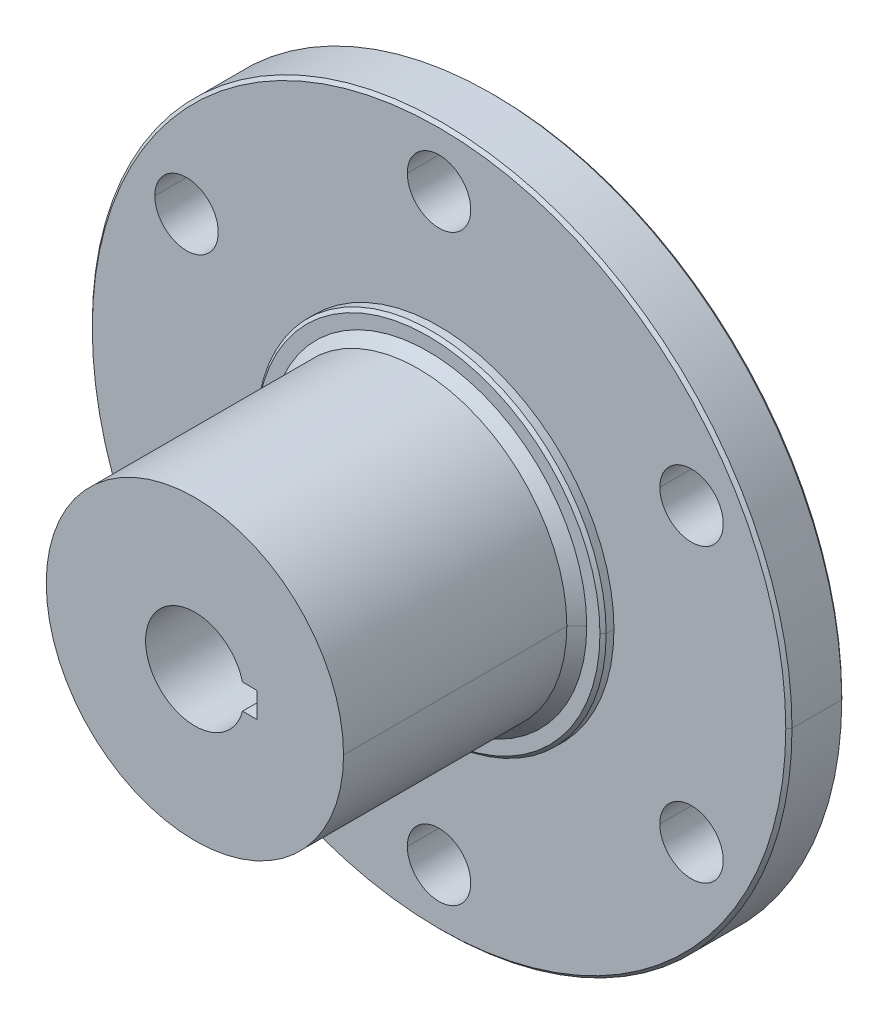
ISO-10303-21;
HEADER;
FILE_DESCRIPTION(('STEP AP214'),'2;1');
FILE_NAME('part.step','',(''),(''),'','','');
FILE_SCHEMA(('AUTOMOTIVE_DESIGN { 1 0 10303 214 1 1 1 1 }'));
ENDSEC;
DATA;
#1=APPLICATION_CONTEXT('core data for automotive mechanical design processes');
#2=APPLICATION_PROTOCOL_DEFINITION('international standard','automotive_design',2000,#1);
#3=PRODUCT_CONTEXT('',#1,'mechanical');
#4=PRODUCT('Part','Part','',(#3));
#5=PRODUCT_RELATED_PRODUCT_CATEGORY('part','',(#4));
#6=PRODUCT_DEFINITION_FORMATION('','',#4);
#7=PRODUCT_DEFINITION_CONTEXT('part definition',#1,'design');
#8=PRODUCT_DEFINITION('design','',#6,#7);
#9=PRODUCT_DEFINITION_SHAPE('','',#8);
#10=(LENGTH_UNIT() NAMED_UNIT(*) SI_UNIT(.MILLI.,.METRE.));
#11=(NAMED_UNIT(*) PLANE_ANGLE_UNIT() SI_UNIT($,.RADIAN.));
#12=(NAMED_UNIT(*) SI_UNIT($,.STERADIAN.) SOLID_ANGLE_UNIT());
#13=UNCERTAINTY_MEASURE_WITH_UNIT(LENGTH_MEASURE(1.E-05),#10,'distance_accuracy_value','');
#14=(GEOMETRIC_REPRESENTATION_CONTEXT(3) GLOBAL_UNCERTAINTY_ASSIGNED_CONTEXT((#13)) GLOBAL_UNIT_ASSIGNED_CONTEXT((#10,
#11,#12)) REPRESENTATION_CONTEXT('',''));
#15=CARTESIAN_POINT('',(0.,0.,0.));
#16=DIRECTION('',(0.,0.,1.));
#17=DIRECTION('',(1.,0.,0.));
#18=AXIS2_PLACEMENT_3D('',#15,#16,#17);
#19=CARTESIAN_POINT('',(0.,0.,7.1628));
#20=DIRECTION('',(0.,0.,-1.));
#21=DIRECTION('',(-1.,0.,0.));
#22=AXIS2_PLACEMENT_3D('',#19,#20,#21);
#23=CONICAL_SURFACE('',#22,12.1412,0.785398163397445);
#24=DIRECTION('',(0.707106781186545,0.,-0.70710678118655));
#25=VECTOR('',#24,1.);
#26=CARTESIAN_POINT('',(12.1412,0.,7.1628));
#27=LINE('',#26,#25);
#28=CARTESIAN_POINT('',(12.1412,0.,7.1628));
#29=VERTEX_POINT('',#28);
#30=CARTESIAN_POINT('',(12.954,0.,6.35));
#31=VERTEX_POINT('',#30);
#32=EDGE_CURVE('E488',#29,#31,#27,.T.);
#33=ORIENTED_EDGE('',*,*,#32,.F.);
#34=CARTESIAN_POINT('',(0.,0.,7.1628));
#35=DIRECTION('',(0.,0.,1.));
#36=DIRECTION('',(1.,0.,0.));
#37=AXIS2_PLACEMENT_3D('',#34,#35,#36);
#38=CIRCLE('',#37,12.1412);
#39=CARTESIAN_POINT('',(-12.1412,0.,7.1628));
#40=VERTEX_POINT('',#39);
#41=EDGE_CURVE('E375',#40,#29,#38,.T.);
#42=ORIENTED_EDGE('',*,*,#41,.F.);
#43=DIRECTION('',(-0.707106781186545,0.,-0.70710678118655));
#44=VECTOR('',#43,1.);
#45=CARTESIAN_POINT('',(-12.1412,0.,7.1628));
#46=LINE('',#45,#44);
#47=CARTESIAN_POINT('',(-12.954,0.,6.35));
#48=VERTEX_POINT('',#47);
#49=EDGE_CURVE('E515',#40,#48,#46,.T.);
#50=ORIENTED_EDGE('',*,*,#49,.T.);
#51=CARTESIAN_POINT('',(0.,0.,6.35));
#52=DIRECTION('',(0.,0.,-1.));
#53=DIRECTION('',(1.,0.,0.));
#54=AXIS2_PLACEMENT_3D('',#51,#52,#53);
#55=CIRCLE('',#54,12.954);
#56=EDGE_CURVE('E365',#31,#48,#55,.T.);
#57=ORIENTED_EDGE('',*,*,#56,.F.);
#58=EDGE_LOOP('',(#33,#42,#50,#57));
#59=FACE_BOUND('',#58,.T.);
#60=ADVANCED_FACE('F17',(#59),#23,.T.);
#61=CARTESIAN_POINT('',(0.,0.,0.889));
#62=DIRECTION('',(0.,0.,1.));
#63=DIRECTION('',(1.,0.,0.));
#64=AXIS2_PLACEMENT_3D('',#61,#62,#63);
#65=CONICAL_SURFACE('',#64,28.321,0.785398163397455);
#66=DIRECTION('',(-0.707106781186552,0.,0.707106781186543));
#67=VECTOR('',#66,1.);
#68=CARTESIAN_POINT('',(-28.321,0.,0.889));
#69=LINE('',#68,#67);
#70=CARTESIAN_POINT('',(-28.321,0.,0.889));
#71=VERTEX_POINT('',#70);
#72=CARTESIAN_POINT('',(-28.575,0.,1.143));
#73=VERTEX_POINT('',#72);
#74=EDGE_CURVE('E526',#71,#73,#69,.T.);
#75=ORIENTED_EDGE('',*,*,#74,.F.);
#76=CARTESIAN_POINT('',(0.,0.,0.889));
#77=DIRECTION('',(0.,0.,-1.));
#78=DIRECTION('',(-1.,0.,0.));
#79=AXIS2_PLACEMENT_3D('',#76,#77,#78);
#80=CIRCLE('',#79,28.321);
#81=CARTESIAN_POINT('',(28.321,0.,0.889));
#82=VERTEX_POINT('',#81);
#83=EDGE_CURVE('E178',#82,#71,#80,.T.);
#84=ORIENTED_EDGE('',*,*,#83,.F.);
#85=DIRECTION('',(0.707106781186552,0.,0.707106781186543));
#86=VECTOR('',#85,1.);
#87=CARTESIAN_POINT('',(28.321,0.,0.889));
#88=LINE('',#87,#86);
#89=CARTESIAN_POINT('',(28.575,0.,1.143));
#90=VERTEX_POINT('',#89);
#91=EDGE_CURVE('E377',#82,#90,#88,.T.);
#92=ORIENTED_EDGE('',*,*,#91,.T.);
#93=CARTESIAN_POINT('',(0.,0.,1.143));
#94=DIRECTION('',(0.,0.,1.));
#95=DIRECTION('',(-1.,0.,0.));
#96=AXIS2_PLACEMENT_3D('',#93,#94,#95);
#97=CIRCLE('',#96,28.575);
#98=EDGE_CURVE('E165',#73,#90,#97,.T.);
#99=ORIENTED_EDGE('',*,*,#98,.F.);
#100=EDGE_LOOP('',(#75,#84,#92,#99));
#101=FACE_BOUND('',#100,.T.);
#102=ADVANCED_FACE('F654',(#101),#65,.T.);
#103=CARTESIAN_POINT('',(0.,0.,5.207));
#104=DIRECTION('',(0.,0.,-1.));
#105=DIRECTION('',(-1.,0.,0.));
#106=AXIS2_PLACEMENT_3D('',#103,#104,#105);
#107=CONICAL_SURFACE('',#106,28.575,0.785398163397455);
#108=DIRECTION('',(0.707106781186552,0.,-0.707106781186543));
#109=VECTOR('',#108,1.);
#110=CARTESIAN_POINT('',(28.575,0.,5.207));
#111=LINE('',#110,#109);
#112=CARTESIAN_POINT('',(28.321,0.,5.461));
#113=VERTEX_POINT('',#112);
#114=CARTESIAN_POINT('',(28.575,0.,5.207));
#115=VERTEX_POINT('',#114);
#116=EDGE_CURVE('E467',#113,#115,#111,.T.);
#117=ORIENTED_EDGE('',*,*,#116,.F.);
#118=CARTESIAN_POINT('',(0.,0.,5.461));
#119=DIRECTION('',(0.,0.,1.));
#120=DIRECTION('',(-1.,0.,0.));
#121=AXIS2_PLACEMENT_3D('',#118,#119,#120);
#122=CIRCLE('',#121,28.321);
#123=CARTESIAN_POINT('',(-28.321,0.,5.461));
#124=VERTEX_POINT('',#123);
#125=EDGE_CURVE('E426',#124,#113,#122,.T.);
#126=ORIENTED_EDGE('',*,*,#125,.F.);
#127=DIRECTION('',(-0.707106781186552,0.,-0.707106781186543));
#128=VECTOR('',#127,1.);
#129=CARTESIAN_POINT('',(-28.575,0.,5.207));
#130=LINE('',#129,#128);
#131=CARTESIAN_POINT('',(-28.575,0.,5.207));
#132=VERTEX_POINT('',#131);
#133=EDGE_CURVE('E576',#124,#132,#130,.T.);
#134=ORIENTED_EDGE('',*,*,#133,.T.);
#135=CARTESIAN_POINT('',(0.,0.,5.207));
#136=DIRECTION('',(0.,0.,-1.));
#137=DIRECTION('',(-1.,0.,0.));
#138=AXIS2_PLACEMENT_3D('',#135,#136,#137);
#139=CIRCLE('',#138,28.575);
#140=EDGE_CURVE('E393',#115,#132,#139,.T.);
#141=ORIENTED_EDGE('',*,*,#140,.F.);
#142=EDGE_LOOP('',(#117,#126,#134,#141));
#143=FACE_BOUND('',#142,.T.);
#144=ADVANCED_FACE('F656',(#143),#107,.T.);
#145=CARTESIAN_POINT('',(0.,0.,0.));
#146=DIRECTION('',(0.,0.,1.));
#147=DIRECTION('',(1.,0.,0.));
#148=AXIS2_PLACEMENT_3D('',#145,#146,#147);
#149=CONICAL_SURFACE('',#148,14.1003226197908,0.785398163397448);
#150=DIRECTION('',(-0.707106781186548,0.,0.707106781186548));
#151=VECTOR('',#150,1.);
#152=CARTESIAN_POINT('',(-14.1003226197908,0.,0.));
#153=LINE('',#152,#151);
#154=CARTESIAN_POINT('',(-14.1003226197908,0.,0.));
#155=VERTEX_POINT('',#154);
#156=CARTESIAN_POINT('',(-14.3543226197908,0.,0.254000000000009));
#157=VERTEX_POINT('',#156);
#158=EDGE_CURVE('E355',#155,#157,#153,.T.);
#159=ORIENTED_EDGE('',*,*,#158,.F.);
#160=CARTESIAN_POINT('',(0.,0.,0.));
#161=DIRECTION('',(0.,0.,-1.));
#162=DIRECTION('',(1.,0.,0.));
#163=AXIS2_PLACEMENT_3D('',#160,#161,#162);
#164=CIRCLE('',#163,14.1003226197908);
#165=CARTESIAN_POINT('',(14.1003226197908,0.,0.));
#166=VERTEX_POINT('',#165);
#167=EDGE_CURVE('E371',#166,#155,#164,.T.);
#168=ORIENTED_EDGE('',*,*,#167,.F.);
#169=DIRECTION('',(0.707106781186548,0.,0.707106781186548));
#170=VECTOR('',#169,1.);
#171=CARTESIAN_POINT('',(14.1003226197908,0.,0.));
#172=LINE('',#171,#170);
#173=CARTESIAN_POINT('',(14.3543226197908,0.,0.254000000000009));
#174=VERTEX_POINT('',#173);
#175=EDGE_CURVE('E354',#166,#174,#172,.T.);
#176=ORIENTED_EDGE('',*,*,#175,.T.);
#177=CARTESIAN_POINT('',(0.,0.,0.254000000000009));
#178=DIRECTION('',(0.,0.,1.));
#179=DIRECTION('',(1.,0.,0.));
#180=AXIS2_PLACEMENT_3D('',#177,#178,#179);
#181=CIRCLE('',#180,14.3543226197908);
#182=EDGE_CURVE('E322',#157,#174,#181,.T.);
#183=ORIENTED_EDGE('',*,*,#182,.F.);
#184=EDGE_LOOP('',(#159,#168,#176,#183));
#185=FACE_BOUND('',#184,.T.);
#186=ADVANCED_FACE('F663',(#185),#149,.T.);
#187=CARTESIAN_POINT('',(0.,0.,6.35));
#188=DIRECTION('',(0.,0.,-1.));
#189=DIRECTION('',(-1.,0.,0.));
#190=AXIS2_PLACEMENT_3D('',#187,#188,#189);
#191=CONICAL_SURFACE('',#190,14.0335,0.785398163397421);
#192=DIRECTION('',(0.707106781186528,0.,-0.707106781186567));
#193=VECTOR('',#192,1.);
#194=CARTESIAN_POINT('',(14.0335,0.,6.35));
#195=LINE('',#194,#193);
#196=CARTESIAN_POINT('',(14.0335,0.,6.35));
#197=VERTEX_POINT('',#196);
#198=CARTESIAN_POINT('',(14.2875,0.,6.096));
#199=VERTEX_POINT('',#198);
#200=EDGE_CURVE('E439',#197,#199,#195,.T.);
#201=ORIENTED_EDGE('',*,*,#200,.F.);
#202=CARTESIAN_POINT('',(0.,0.,6.35));
#203=DIRECTION('',(0.,0.,1.));
#204=DIRECTION('',(1.,0.,0.));
#205=AXIS2_PLACEMENT_3D('',#202,#203,#204);
#206=CIRCLE('',#205,14.0335);
#207=CARTESIAN_POINT('',(-14.0335,0.,6.35));
#208=VERTEX_POINT('',#207);
#209=EDGE_CURVE('E362',#208,#197,#206,.T.);
#210=ORIENTED_EDGE('',*,*,#209,.F.);
#211=DIRECTION('',(-0.707106781186528,0.,-0.707106781186567));
#212=VECTOR('',#211,1.);
#213=CARTESIAN_POINT('',(-14.0335,0.,6.35));
#214=LINE('',#213,#212);
#215=CARTESIAN_POINT('',(-14.2875,0.,6.096));
#216=VERTEX_POINT('',#215);
#217=EDGE_CURVE('E586',#208,#216,#214,.T.);
#218=ORIENTED_EDGE('',*,*,#217,.T.);
#219=CARTESIAN_POINT('',(0.,0.,6.096));
#220=DIRECTION('',(0.,0.,-1.));
#221=DIRECTION('',(1.,0.,0.));
#222=AXIS2_PLACEMENT_3D('',#219,#220,#221);
#223=CIRCLE('',#222,14.2875);
#224=EDGE_CURVE('E11',#199,#216,#223,.T.);
#225=ORIENTED_EDGE('',*,*,#224,.F.);
#226=EDGE_LOOP('',(#201,#210,#218,#225));
#227=FACE_BOUND('',#226,.T.);
#228=ADVANCED_FACE('F991',(#227),#191,.T.);
#229=CARTESIAN_POINT('',(0.,0.,0.));
#230=DIRECTION('',(0.,0.,-1.));
#231=DIRECTION('',(-1.,0.,0.));
#232=AXIS2_PLACEMENT_3D('',#229,#230,#231);
#233=CYLINDRICAL_SURFACE('',#232,14.2875);
#234=DIRECTION('',(0.,0.,-1.));
#235=VECTOR('',#234,1.);
#236=CARTESIAN_POINT('',(14.2875,0.,0.));
#237=LINE('',#236,#235);
#238=CARTESIAN_POINT('',(14.2875,0.,5.461));
#239=VERTEX_POINT('',#238);
#240=EDGE_CURVE('E583',#199,#239,#237,.T.);
#241=ORIENTED_EDGE('',*,*,#240,.F.);
#242=ORIENTED_EDGE('',*,*,#224,.T.);
#243=DIRECTION('',(0.,0.,-1.));
#244=VECTOR('',#243,1.);
#245=CARTESIAN_POINT('',(-14.2875,0.,0.));
#246=LINE('',#245,#244);
#247=CARTESIAN_POINT('',(-14.2875,0.,5.461));
#248=VERTEX_POINT('',#247);
#249=EDGE_CURVE('E335',#216,#248,#246,.T.);
#250=ORIENTED_EDGE('',*,*,#249,.T.);
#251=CARTESIAN_POINT('',(0.,0.,5.461));
#252=DIRECTION('',(0.,0.,-1.));
#253=DIRECTION('',(-1.,0.,0.));
#254=AXIS2_PLACEMENT_3D('',#251,#252,#253);
#255=CIRCLE('',#254,14.2875);
#256=EDGE_CURVE('E28',#239,#248,#255,.T.);
#257=ORIENTED_EDGE('',*,*,#256,.F.);
#258=EDGE_LOOP('',(#241,#242,#250,#257));
#259=FACE_BOUND('',#258,.T.);
#260=ADVANCED_FACE('F696',(#259),#233,.T.);
#261=CARTESIAN_POINT('',(-62.1712615480534,0.,5.461));
#262=DIRECTION('',(0.,0.,-1.));
#263=DIRECTION('',(0.,-1.,0.));
#264=AXIS2_PLACEMENT_3D('',#261,#262,#263);
#265=PLANE('',#264);
#266=CARTESIAN_POINT('',(-20.622229927617,11.90625,5.461));
#267=DIRECTION('',(0.,0.,1.));
#268=DIRECTION('',(-1.,0.,0.));
#269=AXIS2_PLACEMENT_3D('',#266,#267,#268);
#270=CIRCLE('',#269,2.5908);
#271=CARTESIAN_POINT('',(-18.031429927617,11.90625,5.461));
#272=VERTEX_POINT('',#271);
#273=CARTESIAN_POINT('',(-23.213029927617,11.90625,5.461));
#274=VERTEX_POINT('',#273);
#275=EDGE_CURVE('E422',#272,#274,#270,.T.);
#276=ORIENTED_EDGE('',*,*,#275,.F.);
#277=CARTESIAN_POINT('',(-20.622229927617,11.90625,5.461));
#278=DIRECTION('',(0.,0.,1.));
#279=DIRECTION('',(-1.,0.,0.));
#280=AXIS2_PLACEMENT_3D('',#277,#278,#279);
#281=CIRCLE('',#280,2.5908);
#282=EDGE_CURVE('E542',#274,#272,#281,.T.);
#283=ORIENTED_EDGE('',*,*,#282,.F.);
#284=EDGE_LOOP('',(#276,#283));
#285=FACE_BOUND('',#284,.T.);
#286=CARTESIAN_POINT('',(0.,-23.8125,5.461));
#287=DIRECTION('',(0.,0.,1.));
#288=DIRECTION('',(-1.,0.,0.));
#289=AXIS2_PLACEMENT_3D('',#286,#287,#288);
#290=CIRCLE('',#289,2.5908);
#291=CARTESIAN_POINT('',(2.5908,-23.8125,5.461));
#292=VERTEX_POINT('',#291);
#293=CARTESIAN_POINT('',(-2.5908,-23.8125,5.461));
#294=VERTEX_POINT('',#293);
#295=EDGE_CURVE('E563',#292,#294,#290,.T.);
#296=ORIENTED_EDGE('',*,*,#295,.F.);
#297=CARTESIAN_POINT('',(0.,-23.8125,5.461));
#298=DIRECTION('',(0.,0.,1.));
#299=DIRECTION('',(-1.,0.,0.));
#300=AXIS2_PLACEMENT_3D('',#297,#298,#299);
#301=CIRCLE('',#300,2.5908);
#302=EDGE_CURVE('E386',#294,#292,#301,.T.);
#303=ORIENTED_EDGE('',*,*,#302,.F.);
#304=EDGE_LOOP('',(#296,#303));
#305=FACE_BOUND('',#304,.T.);
#306=CARTESIAN_POINT('',(20.6222299276168,11.9062500000002,5.461));
#307=DIRECTION('',(0.,0.,1.));
#308=DIRECTION('',(-1.,0.,0.));
#309=AXIS2_PLACEMENT_3D('',#306,#307,#308);
#310=CIRCLE('',#309,2.5908);
#311=CARTESIAN_POINT('',(23.2130299276168,11.9062500000002,5.461));
#312=VERTEX_POINT('',#311);
#313=CARTESIAN_POINT('',(18.0314299276168,11.9062500000002,5.461));
#314=VERTEX_POINT('',#313);
#315=EDGE_CURVE('E367',#312,#314,#310,.T.);
#316=ORIENTED_EDGE('',*,*,#315,.F.);
#317=CARTESIAN_POINT('',(20.6222299276168,11.9062500000002,5.461));
#318=DIRECTION('',(0.,0.,1.));
#319=DIRECTION('',(-1.,0.,0.));
#320=AXIS2_PLACEMENT_3D('',#317,#318,#319);
#321=CIRCLE('',#320,2.5908);
#322=EDGE_CURVE('E429',#314,#312,#321,.T.);
#323=ORIENTED_EDGE('',*,*,#322,.F.);
#324=EDGE_LOOP('',(#316,#323));
#325=FACE_BOUND('',#324,.T.);
#326=CARTESIAN_POINT('',(0.,0.,5.461));
#327=DIRECTION('',(0.,0.,-1.));
#328=DIRECTION('',(-1.,0.,0.));
#329=AXIS2_PLACEMENT_3D('',#326,#327,#328);
#330=CIRCLE('',#329,14.2875);
#331=EDGE_CURVE('E343',#248,#239,#330,.T.);
#332=ORIENTED_EDGE('',*,*,#331,.T.);
#333=ORIENTED_EDGE('',*,*,#256,.T.);
#334=EDGE_LOOP('',(#332,#333));
#335=FACE_BOUND('',#334,.T.);
#336=CARTESIAN_POINT('',(20.622229927617,-11.9062499999998,5.461));
#337=DIRECTION('',(0.,0.,1.));
#338=DIRECTION('',(-1.,0.,0.));
#339=AXIS2_PLACEMENT_3D('',#336,#337,#338);
#340=CIRCLE('',#339,2.5908);
#341=CARTESIAN_POINT('',(23.2130299276171,-11.9062499999998,5.461));
#342=VERTEX_POINT('',#341);
#343=CARTESIAN_POINT('',(18.0314299276171,-11.9062499999998,5.461));
#344=VERTEX_POINT('',#343);
#345=EDGE_CURVE('E475',#342,#344,#340,.T.);
#346=ORIENTED_EDGE('',*,*,#345,.F.);
#347=CARTESIAN_POINT('',(20.622229927617,-11.9062499999998,5.461));
#348=DIRECTION('',(0.,0.,1.));
#349=DIRECTION('',(-1.,0.,0.));
#350=AXIS2_PLACEMENT_3D('',#347,#348,#349);
#351=CIRCLE('',#350,2.5908);
#352=EDGE_CURVE('E356',#344,#342,#351,.T.);
#353=ORIENTED_EDGE('',*,*,#352,.F.);
#354=EDGE_LOOP('',(#346,#353));
#355=FACE_BOUND('',#354,.T.);
#356=CARTESIAN_POINT('',(-20.6222299276169,-11.90625,5.461));
#357=DIRECTION('',(0.,0.,1.));
#358=DIRECTION('',(-1.,0.,0.));
#359=AXIS2_PLACEMENT_3D('',#356,#357,#358);
#360=CIRCLE('',#359,2.5908);
#361=CARTESIAN_POINT('',(-18.0314299276169,-11.90625,5.461));
#362=VERTEX_POINT('',#361);
#363=CARTESIAN_POINT('',(-23.2130299276169,-11.90625,5.461));
#364=VERTEX_POINT('',#363);
#365=EDGE_CURVE('E448',#362,#364,#360,.T.);
#366=ORIENTED_EDGE('',*,*,#365,.F.);
#367=CARTESIAN_POINT('',(-20.6222299276169,-11.90625,5.461));
#368=DIRECTION('',(0.,0.,1.));
#369=DIRECTION('',(-1.,0.,0.));
#370=AXIS2_PLACEMENT_3D('',#367,#368,#369);
#371=CIRCLE('',#370,2.5908);
#372=EDGE_CURVE('E556',#364,#362,#371,.T.);
#373=ORIENTED_EDGE('',*,*,#372,.F.);
#374=EDGE_LOOP('',(#366,#373));
#375=FACE_BOUND('',#374,.T.);
#376=CARTESIAN_POINT('',(0.,23.8125,5.461));
#377=DIRECTION('',(0.,0.,1.));
#378=DIRECTION('',(-1.,0.,0.));
#379=AXIS2_PLACEMENT_3D('',#376,#377,#378);
#380=CIRCLE('',#379,2.5908);
#381=CARTESIAN_POINT('',(2.5908,23.8125,5.461));
#382=VERTEX_POINT('',#381);
#383=CARTESIAN_POINT('',(-2.5908,23.8125,5.461));
#384=VERTEX_POINT('',#383);
#385=EDGE_CURVE('E423',#382,#384,#380,.T.);
#386=ORIENTED_EDGE('',*,*,#385,.F.);
#387=CARTESIAN_POINT('',(0.,23.8125,5.461));
#388=DIRECTION('',(0.,0.,1.));
#389=DIRECTION('',(-1.,0.,0.));
#390=AXIS2_PLACEMENT_3D('',#387,#388,#389);
#391=CIRCLE('',#390,2.5908);
#392=EDGE_CURVE('E548',#384,#382,#391,.T.);
#393=ORIENTED_EDGE('',*,*,#392,.F.);
#394=EDGE_LOOP('',(#386,#393));
#395=FACE_BOUND('',#394,.T.);
#396=ORIENTED_EDGE('',*,*,#125,.T.);
#397=CARTESIAN_POINT('',(0.,0.,5.461));
#398=DIRECTION('',(0.,0.,1.));
#399=DIRECTION('',(-1.,0.,0.));
#400=AXIS2_PLACEMENT_3D('',#397,#398,#399);
#401=CIRCLE('',#400,28.321);
#402=EDGE_CURVE('E380',#113,#124,#401,.T.);
#403=ORIENTED_EDGE('',*,*,#402,.T.);
#404=EDGE_LOOP('',(#396,#403));
#405=FACE_BOUND('',#404,.T.);
#406=ADVANCED_FACE('F693',(#285,#305,#325,#335,#355,#375,#395,#405),#265,.F.);
#407=CARTESIAN_POINT('',(-62.1712615480534,0.,0.889));
#408=DIRECTION('',(0.,0.,-1.));
#409=DIRECTION('',(0.,-1.,0.));
#410=AXIS2_PLACEMENT_3D('',#407,#408,#409);
#411=PLANE('',#410);
#412=CARTESIAN_POINT('',(-20.6222299276169,11.90625,0.889));
#413=DIRECTION('',(0.,0.,1.));
#414=DIRECTION('',(-1.,0.,0.));
#415=AXIS2_PLACEMENT_3D('',#412,#413,#414);
#416=CIRCLE('',#415,2.5908);
#417=CARTESIAN_POINT('',(-18.031429927617,11.90625,0.889));
#418=VERTEX_POINT('',#417);
#419=CARTESIAN_POINT('',(-23.213029927617,11.90625,0.889));
#420=VERTEX_POINT('',#419);
#421=EDGE_CURVE('E419',#418,#420,#416,.T.);
#422=ORIENTED_EDGE('',*,*,#421,.T.);
#423=CARTESIAN_POINT('',(-20.6222299276169,11.90625,0.889));
#424=DIRECTION('',(0.,0.,1.));
#425=DIRECTION('',(-1.,0.,0.));
#426=AXIS2_PLACEMENT_3D('',#423,#424,#425);
#427=CIRCLE('',#426,2.5908);
#428=EDGE_CURVE('E388',#420,#418,#427,.T.);
#429=ORIENTED_EDGE('',*,*,#428,.T.);
#430=EDGE_LOOP('',(#422,#429));
#431=FACE_BOUND('',#430,.T.);
#432=CARTESIAN_POINT('',(0.,-23.8125,0.889));
#433=DIRECTION('',(0.,0.,1.));
#434=DIRECTION('',(-1.,0.,0.));
#435=AXIS2_PLACEMENT_3D('',#432,#433,#434);
#436=CIRCLE('',#435,2.5908);
#437=CARTESIAN_POINT('',(2.5908,-23.8125,0.889));
#438=VERTEX_POINT('',#437);
#439=CARTESIAN_POINT('',(-2.5908,-23.8125,0.889));
#440=VERTEX_POINT('',#439);
#441=EDGE_CURVE('E452',#438,#440,#436,.T.);
#442=ORIENTED_EDGE('',*,*,#441,.T.);
#443=CARTESIAN_POINT('',(0.,-23.8125,0.889));
#444=DIRECTION('',(0.,0.,1.));
#445=DIRECTION('',(-1.,0.,0.));
#446=AXIS2_PLACEMENT_3D('',#443,#444,#445);
#447=CIRCLE('',#446,2.5908);
#448=EDGE_CURVE('E387',#440,#438,#447,.T.);
#449=ORIENTED_EDGE('',*,*,#448,.T.);
#450=EDGE_LOOP('',(#442,#449));
#451=FACE_BOUND('',#450,.T.);
#452=CARTESIAN_POINT('',(20.6222299276168,11.9062500000002,0.889));
#453=DIRECTION('',(0.,0.,1.));
#454=DIRECTION('',(-1.,0.,0.));
#455=AXIS2_PLACEMENT_3D('',#452,#453,#454);
#456=CIRCLE('',#455,2.5908);
#457=CARTESIAN_POINT('',(23.2130299276168,11.9062500000002,0.889));
#458=VERTEX_POINT('',#457);
#459=CARTESIAN_POINT('',(18.0314299276168,11.9062500000002,0.889));
#460=VERTEX_POINT('',#459);
#461=EDGE_CURVE('E286',#458,#460,#456,.T.);
#462=ORIENTED_EDGE('',*,*,#461,.T.);
#463=CARTESIAN_POINT('',(20.6222299276168,11.9062500000002,0.889));
#464=DIRECTION('',(0.,0.,1.));
#465=DIRECTION('',(-1.,0.,0.));
#466=AXIS2_PLACEMENT_3D('',#463,#464,#465);
#467=CIRCLE('',#466,2.5908);
#468=EDGE_CURVE('E567',#460,#458,#467,.T.);
#469=ORIENTED_EDGE('',*,*,#468,.T.);
#470=EDGE_LOOP('',(#462,#469));
#471=FACE_BOUND('',#470,.T.);
#472=CARTESIAN_POINT('',(0.,0.,0.889));
#473=DIRECTION('',(0.,0.,-1.));
#474=DIRECTION('',(-1.,0.,0.));
#475=AXIS2_PLACEMENT_3D('',#472,#473,#474);
#476=CIRCLE('',#475,14.3543226197908);
#477=CARTESIAN_POINT('',(-14.3543226197908,0.,0.889));
#478=VERTEX_POINT('',#477);
#479=CARTESIAN_POINT('',(14.3543226197908,0.,0.889));
#480=VERTEX_POINT('',#479);
#481=EDGE_CURVE('E317',#478,#480,#476,.T.);
#482=ORIENTED_EDGE('',*,*,#481,.F.);
#483=CARTESIAN_POINT('',(0.,0.,0.889));
#484=DIRECTION('',(0.,0.,-1.));
#485=DIRECTION('',(-1.,0.,0.));
#486=AXIS2_PLACEMENT_3D('',#483,#484,#485);
#487=CIRCLE('',#486,14.3543226197908);
#488=EDGE_CURVE('E312',#480,#478,#487,.T.);
#489=ORIENTED_EDGE('',*,*,#488,.F.);
#490=EDGE_LOOP('',(#482,#489));
#491=FACE_BOUND('',#490,.T.);
#492=CARTESIAN_POINT('',(20.622229927617,-11.9062499999998,0.889));
#493=DIRECTION('',(0.,0.,1.));
#494=DIRECTION('',(-1.,0.,0.));
#495=AXIS2_PLACEMENT_3D('',#492,#493,#494);
#496=CIRCLE('',#495,2.5908);
#497=CARTESIAN_POINT('',(23.2130299276171,-11.9062499999998,0.889));
#498=VERTEX_POINT('',#497);
#499=CARTESIAN_POINT('',(18.0314299276171,-11.9062499999998,0.889));
#500=VERTEX_POINT('',#499);
#501=EDGE_CURVE('E347',#498,#500,#496,.T.);
#502=ORIENTED_EDGE('',*,*,#501,.T.);
#503=CARTESIAN_POINT('',(20.622229927617,-11.9062499999998,0.889));
#504=DIRECTION('',(0.,0.,1.));
#505=DIRECTION('',(-1.,0.,0.));
#506=AXIS2_PLACEMENT_3D('',#503,#504,#505);
#507=CIRCLE('',#506,2.5908);
#508=EDGE_CURVE('E497',#500,#498,#507,.T.);
#509=ORIENTED_EDGE('',*,*,#508,.T.);
#510=EDGE_LOOP('',(#502,#509));
#511=FACE_BOUND('',#510,.T.);
#512=CARTESIAN_POINT('',(-20.6222299276169,-11.90625,0.889));
#513=DIRECTION('',(0.,0.,1.));
#514=DIRECTION('',(-1.,0.,0.));
#515=AXIS2_PLACEMENT_3D('',#512,#513,#514);
#516=CIRCLE('',#515,2.5908);
#517=CARTESIAN_POINT('',(-18.0314299276169,-11.90625,0.889));
#518=VERTEX_POINT('',#517);
#519=CARTESIAN_POINT('',(-23.2130299276169,-11.90625,0.889));
#520=VERTEX_POINT('',#519);
#521=EDGE_CURVE('E254',#518,#520,#516,.T.);
#522=ORIENTED_EDGE('',*,*,#521,.T.);
#523=CARTESIAN_POINT('',(-20.6222299276169,-11.90625,0.889));
#524=DIRECTION('',(0.,0.,1.));
#525=DIRECTION('',(-1.,0.,0.));
#526=AXIS2_PLACEMENT_3D('',#523,#524,#525);
#527=CIRCLE('',#526,2.5908);
#528=EDGE_CURVE('E446',#520,#518,#527,.T.);
#529=ORIENTED_EDGE('',*,*,#528,.T.);
#530=EDGE_LOOP('',(#522,#529));
#531=FACE_BOUND('',#530,.T.);
#532=CARTESIAN_POINT('',(0.,23.8125,0.889));
#533=DIRECTION('',(0.,0.,1.));
#534=DIRECTION('',(-1.,0.,0.));
#535=AXIS2_PLACEMENT_3D('',#532,#533,#534);
#536=CIRCLE('',#535,2.5908);
#537=CARTESIAN_POINT('',(2.5908,23.8125,0.889));
#538=VERTEX_POINT('',#537);
#539=CARTESIAN_POINT('',(-2.5908,23.8125,0.889));
#540=VERTEX_POINT('',#539);
#541=EDGE_CURVE('E473',#538,#540,#536,.T.);
#542=ORIENTED_EDGE('',*,*,#541,.T.);
#543=CARTESIAN_POINT('',(0.,23.8125,0.889));
#544=DIRECTION('',(0.,0.,1.));
#545=DIRECTION('',(-1.,0.,0.));
#546=AXIS2_PLACEMENT_3D('',#543,#544,#545);
#547=CIRCLE('',#546,2.5908);
#548=EDGE_CURVE('E541',#540,#538,#547,.T.);
#549=ORIENTED_EDGE('',*,*,#548,.T.);
#550=EDGE_LOOP('',(#542,#549));
#551=FACE_BOUND('',#550,.T.);
#552=ORIENTED_EDGE('',*,*,#83,.T.);
#553=CARTESIAN_POINT('',(0.,0.,0.889));
#554=DIRECTION('',(0.,0.,-1.));
#555=DIRECTION('',(-1.,0.,0.));
#556=AXIS2_PLACEMENT_3D('',#553,#554,#555);
#557=CIRCLE('',#556,28.321);
#558=EDGE_CURVE('E415',#71,#82,#557,.T.);
#559=ORIENTED_EDGE('',*,*,#558,.T.);
#560=EDGE_LOOP('',(#552,#559));
#561=FACE_BOUND('',#560,.T.);
#562=ADVANCED_FACE('F314',(#431,#451,#471,#491,#511,#531,#551,#561),#411,.T.);
#563=CARTESIAN_POINT('',(0.,0.,0.));
#564=DIRECTION('',(0.,0.,-1.));
#565=DIRECTION('',(-1.,0.,0.));
#566=AXIS2_PLACEMENT_3D('',#563,#564,#565);
#567=CYLINDRICAL_SURFACE('',#566,14.3543226197908);
#568=DIRECTION('',(0.,0.,-1.));
#569=VECTOR('',#568,1.);
#570=CARTESIAN_POINT('',(14.3543226197908,0.,0.));
#571=LINE('',#570,#569);
#572=EDGE_CURVE('E325',#480,#174,#571,.T.);
#573=ORIENTED_EDGE('',*,*,#572,.F.);
#574=ORIENTED_EDGE('',*,*,#488,.T.);
#575=DIRECTION('',(0.,0.,-1.));
#576=VECTOR('',#575,1.);
#577=CARTESIAN_POINT('',(-14.3543226197908,0.,0.));
#578=LINE('',#577,#576);
#579=EDGE_CURVE('E331',#478,#157,#578,.T.);
#580=ORIENTED_EDGE('',*,*,#579,.T.);
#581=ORIENTED_EDGE('',*,*,#182,.T.);
#582=EDGE_LOOP('',(#573,#574,#580,#581));
#583=FACE_BOUND('',#582,.T.);
#584=ADVANCED_FACE('F326',(#583),#567,.T.);
#585=CARTESIAN_POINT('',(3.89225476041844,1.0287,0.));
#586=DIRECTION('',(0.,1.,0.));
#587=DIRECTION('',(1.,0.,0.));
#588=AXIS2_PLACEMENT_3D('',#585,#586,#587);
#589=PLANE('',#588);
#590=DIRECTION('',(-1.,0.,0.));
#591=VECTOR('',#590,1.);
#592=CARTESIAN_POINT('',(3.89225476041844,1.0287,25.4));
#593=LINE('',#592,#591);
#594=CARTESIAN_POINT('',(5.0546,1.0287,25.4));
#595=VERTEX_POINT('',#594);
#596=CARTESIAN_POINT('',(3.89225476041844,1.0287,25.4));
#597=VERTEX_POINT('',#596);
#598=EDGE_CURVE('E397',#595,#597,#593,.T.);
#599=ORIENTED_EDGE('',*,*,#598,.T.);
#600=DIRECTION('',(0.,0.,1.));
#601=VECTOR('',#600,1.);
#602=CARTESIAN_POINT('',(3.89225476041844,1.0287,0.));
#603=LINE('',#602,#601);
#604=CARTESIAN_POINT('',(3.89225476041844,1.0287,0.));
#605=VERTEX_POINT('',#604);
#606=EDGE_CURVE('E43',#605,#597,#603,.T.);
#607=ORIENTED_EDGE('',*,*,#606,.F.);
#608=DIRECTION('',(-1.,0.,0.));
#609=VECTOR('',#608,1.);
#610=CARTESIAN_POINT('',(3.89225476041844,1.0287,0.));
#611=LINE('',#610,#609);
#612=CARTESIAN_POINT('',(5.0546,1.0287,0.));
#613=VERTEX_POINT('',#612);
#614=EDGE_CURVE('E590',#613,#605,#611,.T.);
#615=ORIENTED_EDGE('',*,*,#614,.F.);
#616=DIRECTION('',(0.,0.,1.));
#617=VECTOR('',#616,1.);
#618=CARTESIAN_POINT('',(5.0546,1.0287,0.));
#619=LINE('',#618,#617);
#620=EDGE_CURVE('E93',#613,#595,#619,.T.);
#621=ORIENTED_EDGE('',*,*,#620,.T.);
#622=EDGE_LOOP('',(#599,#607,#615,#621));
#623=FACE_BOUND('',#622,.T.);
#624=ADVANCED_FACE('F750',(#623),#589,.F.);
#625=CARTESIAN_POINT('',(0.,0.,0.));
#626=DIRECTION('',(0.,0.,1.));
#627=DIRECTION('',(1.,0.,0.));
#628=AXIS2_PLACEMENT_3D('',#625,#626,#627);
#629=CYLINDRICAL_SURFACE('',#628,4.0259);
#630=CARTESIAN_POINT('',(0.,0.,25.4));
#631=DIRECTION('',(0.,0.,1.));
#632=DIRECTION('',(1.,0.,0.));
#633=AXIS2_PLACEMENT_3D('',#630,#631,#632);
#634=CIRCLE('',#633,4.0259);
#635=CARTESIAN_POINT('',(3.89225476041844,-1.0287,25.4));
#636=VERTEX_POINT('',#635);
#637=EDGE_CURVE('E395',#597,#636,#634,.T.);
#638=ORIENTED_EDGE('',*,*,#637,.T.);
#639=DIRECTION('',(0.,0.,1.));
#640=VECTOR('',#639,1.);
#641=CARTESIAN_POINT('',(3.89225476041844,-1.0287,0.));
#642=LINE('',#641,#640);
#643=CARTESIAN_POINT('',(3.89225476041844,-1.0287,0.));
#644=VERTEX_POINT('',#643);
#645=EDGE_CURVE('E417',#644,#636,#642,.T.);
#646=ORIENTED_EDGE('',*,*,#645,.F.);
#647=CARTESIAN_POINT('',(0.,0.,0.));
#648=DIRECTION('',(0.,0.,1.));
#649=DIRECTION('',(1.,0.,0.));
#650=AXIS2_PLACEMENT_3D('',#647,#648,#649);
#651=CIRCLE('',#650,4.0259);
#652=EDGE_CURVE('E593',#605,#644,#651,.T.);
#653=ORIENTED_EDGE('',*,*,#652,.F.);
#654=ORIENTED_EDGE('',*,*,#606,.T.);
#655=EDGE_LOOP('',(#638,#646,#653,#654));
#656=FACE_BOUND('',#655,.T.);
#657=ADVANCED_FACE('F751',(#656),#629,.F.);
#658=CARTESIAN_POINT('',(3.89225476041844,-1.0287,0.));
#659=DIRECTION('',(0.,-1.,0.));
#660=DIRECTION('',(-1.,0.,0.));
#661=AXIS2_PLACEMENT_3D('',#658,#659,#660);
#662=PLANE('',#661);
#663=DIRECTION('',(1.,0.,0.));
#664=VECTOR('',#663,1.);
#665=CARTESIAN_POINT('',(3.89225476041844,-1.0287,25.4));
#666=LINE('',#665,#664);
#667=CARTESIAN_POINT('',(5.0546,-1.0287,25.4));
#668=VERTEX_POINT('',#667);
#669=EDGE_CURVE('E374',#636,#668,#666,.T.);
#670=ORIENTED_EDGE('',*,*,#669,.T.);
#671=DIRECTION('',(0.,0.,1.));
#672=VECTOR('',#671,1.);
#673=CARTESIAN_POINT('',(5.0546,-1.0287,0.));
#674=LINE('',#673,#672);
#675=CARTESIAN_POINT('',(5.0546,-1.0287,0.));
#676=VERTEX_POINT('',#675);
#677=EDGE_CURVE('E107',#676,#668,#674,.T.);
#678=ORIENTED_EDGE('',*,*,#677,.F.);
#679=DIRECTION('',(1.,0.,0.));
#680=VECTOR('',#679,1.);
#681=CARTESIAN_POINT('',(3.89225476041844,-1.0287,0.));
#682=LINE('',#681,#680);
#683=EDGE_CURVE('E487',#644,#676,#682,.T.);
#684=ORIENTED_EDGE('',*,*,#683,.F.);
#685=ORIENTED_EDGE('',*,*,#645,.T.);
#686=EDGE_LOOP('',(#670,#678,#684,#685));
#687=FACE_BOUND('',#686,.T.);
#688=ADVANCED_FACE('F748',(#687),#662,.F.);
#689=CARTESIAN_POINT('',(5.0546,1.0287,0.));
#690=DIRECTION('',(1.,0.,0.));
#691=DIRECTION('',(0.,1.,0.));
#692=AXIS2_PLACEMENT_3D('',#689,#690,#691);
#693=PLANE('',#692);
#694=DIRECTION('',(0.,1.,0.));
#695=VECTOR('',#694,1.);
#696=CARTESIAN_POINT('',(5.0546,1.0287,25.4));
#697=LINE('',#696,#695);
#698=EDGE_CURVE('E372',#668,#595,#697,.T.);
#699=ORIENTED_EDGE('',*,*,#698,.T.);
#700=ORIENTED_EDGE('',*,*,#620,.F.);
#701=DIRECTION('',(0.,1.,0.));
#702=VECTOR('',#701,1.);
#703=CARTESIAN_POINT('',(5.0546,1.0287,0.));
#704=LINE('',#703,#702);
#705=EDGE_CURVE('E594',#676,#613,#704,.T.);
#706=ORIENTED_EDGE('',*,*,#705,.F.);
#707=ORIENTED_EDGE('',*,*,#677,.T.);
#708=EDGE_LOOP('',(#699,#700,#706,#707));
#709=FACE_BOUND('',#708,.T.);
#710=ADVANCED_FACE('F749',(#709),#693,.F.);
#711=CARTESIAN_POINT('',(0.,0.,25.4));
#712=DIRECTION('',(0.,0.,1.));
#713=DIRECTION('',(1.,0.,0.));
#714=AXIS2_PLACEMENT_3D('',#711,#712,#713);
#715=PLANE('',#714);
#716=ORIENTED_EDGE('',*,*,#698,.F.);
#717=ORIENTED_EDGE('',*,*,#669,.F.);
#718=ORIENTED_EDGE('',*,*,#637,.F.);
#719=ORIENTED_EDGE('',*,*,#598,.F.);
#720=EDGE_LOOP('',(#716,#717,#718,#719));
#721=FACE_BOUND('',#720,.T.);
#722=CARTESIAN_POINT('',(0.,0.,25.4));
#723=DIRECTION('',(0.,0.,1.));
#724=DIRECTION('',(1.,0.,0.));
#725=AXIS2_PLACEMENT_3D('',#722,#723,#724);
#726=CIRCLE('',#725,12.1412);
#727=CARTESIAN_POINT('',(-12.1412,0.,25.4));
#728=VERTEX_POINT('',#727);
#729=CARTESIAN_POINT('',(12.1412,0.,25.4));
#730=VERTEX_POINT('',#729);
#731=EDGE_CURVE('E301',#728,#730,#726,.T.);
#732=ORIENTED_EDGE('',*,*,#731,.T.);
#733=CARTESIAN_POINT('',(0.,0.,25.4));
#734=DIRECTION('',(0.,0.,1.));
#735=DIRECTION('',(1.,0.,0.));
#736=AXIS2_PLACEMENT_3D('',#733,#734,#735);
#737=CIRCLE('',#736,12.1412);
#738=EDGE_CURVE('E350',#730,#728,#737,.T.);
#739=ORIENTED_EDGE('',*,*,#738,.T.);
#740=EDGE_LOOP('',(#732,#739));
#741=FACE_BOUND('',#740,.T.);
#742=ADVANCED_FACE('F775',(#721,#741),#715,.T.);
#743=CARTESIAN_POINT('',(0.,0.,25.4));
#744=DIRECTION('',(0.,0.,-1.));
#745=DIRECTION('',(-1.,0.,0.));
#746=AXIS2_PLACEMENT_3D('',#743,#744,#745);
#747=CYLINDRICAL_SURFACE('',#746,12.1412);
#748=DIRECTION('',(0.,0.,-1.));
#749=VECTOR('',#748,1.);
#750=CARTESIAN_POINT('',(12.1412,0.,25.4));
#751=LINE('',#750,#749);
#752=EDGE_CURVE('E481',#730,#29,#751,.T.);
#753=ORIENTED_EDGE('',*,*,#752,.F.);
#754=ORIENTED_EDGE('',*,*,#731,.F.);
#755=DIRECTION('',(0.,0.,-1.));
#756=VECTOR('',#755,1.);
#757=CARTESIAN_POINT('',(-12.1412,0.,25.4));
#758=LINE('',#757,#756);
#759=EDGE_CURVE('E508',#728,#40,#758,.T.);
#760=ORIENTED_EDGE('',*,*,#759,.T.);
#761=ORIENTED_EDGE('',*,*,#41,.T.);
#762=EDGE_LOOP('',(#753,#754,#760,#761));
#763=FACE_BOUND('',#762,.T.);
#764=ADVANCED_FACE('F762',(#763),#747,.T.);
#765=CARTESIAN_POINT('',(0.,0.,0.));
#766=DIRECTION('',(0.,0.,1.));
#767=DIRECTION('',(1.,0.,0.));
#768=AXIS2_PLACEMENT_3D('',#765,#766,#767);
#769=PLANE('',#768);
#770=ORIENTED_EDGE('',*,*,#683,.T.);
#771=ORIENTED_EDGE('',*,*,#705,.T.);
#772=ORIENTED_EDGE('',*,*,#614,.T.);
#773=ORIENTED_EDGE('',*,*,#652,.T.);
#774=EDGE_LOOP('',(#770,#771,#772,#773));
#775=FACE_BOUND('',#774,.T.);
#776=ORIENTED_EDGE('',*,*,#167,.T.);
#777=CARTESIAN_POINT('',(0.,0.,0.));
#778=DIRECTION('',(0.,0.,-1.));
#779=DIRECTION('',(1.,0.,0.));
#780=AXIS2_PLACEMENT_3D('',#777,#778,#779);
#781=CIRCLE('',#780,14.1003226197908);
#782=EDGE_CURVE('E572',#155,#166,#781,.T.);
#783=ORIENTED_EDGE('',*,*,#782,.T.);
#784=EDGE_LOOP('',(#776,#783));
#785=FACE_BOUND('',#784,.T.);
#786=ADVANCED_FACE('F746',(#775,#785),#769,.F.);
#787=CARTESIAN_POINT('',(20.6222299276168,11.9062500000002,0.));
#788=DIRECTION('',(0.,0.,1.));
#789=DIRECTION('',(1.,0.,0.));
#790=AXIS2_PLACEMENT_3D('',#787,#788,#789);
#791=CYLINDRICAL_SURFACE('',#790,2.5908);
#792=DIRECTION('',(0.,0.,1.));
#793=VECTOR('',#792,1.);
#794=CARTESIAN_POINT('',(18.0314299276168,11.9062500000002,0.));
#795=LINE('',#794,#793);
#796=EDGE_CURVE('E434',#460,#314,#795,.T.);
#797=ORIENTED_EDGE('',*,*,#796,.F.);
#798=ORIENTED_EDGE('',*,*,#461,.F.);
#799=DIRECTION('',(0.,0.,1.));
#800=VECTOR('',#799,1.);
#801=CARTESIAN_POINT('',(23.2130299276168,11.9062500000002,0.));
#802=LINE('',#801,#800);
#803=EDGE_CURVE('E433',#458,#312,#802,.T.);
#804=ORIENTED_EDGE('',*,*,#803,.T.);
#805=ORIENTED_EDGE('',*,*,#315,.T.);
#806=EDGE_LOOP('',(#797,#798,#804,#805));
#807=FACE_BOUND('',#806,.T.);
#808=ADVANCED_FACE('F19',(#807),#791,.F.);
#809=CARTESIAN_POINT('',(20.622229927617,-11.9062499999998,0.));
#810=DIRECTION('',(0.,0.,1.));
#811=DIRECTION('',(1.,0.,0.));
#812=AXIS2_PLACEMENT_3D('',#809,#810,#811);
#813=CYLINDRICAL_SURFACE('',#812,2.5908);
#814=DIRECTION('',(0.,0.,1.));
#815=VECTOR('',#814,1.);
#816=CARTESIAN_POINT('',(18.0314299276171,-11.9062499999998,0.));
#817=LINE('',#816,#815);
#818=EDGE_CURVE('E361',#500,#344,#817,.T.);
#819=ORIENTED_EDGE('',*,*,#818,.F.);
#820=ORIENTED_EDGE('',*,*,#501,.F.);
#821=DIRECTION('',(0.,0.,1.));
#822=VECTOR('',#821,1.);
#823=CARTESIAN_POINT('',(23.2130299276171,-11.9062499999998,0.));
#824=LINE('',#823,#822);
#825=EDGE_CURVE('E360',#498,#342,#824,.T.);
#826=ORIENTED_EDGE('',*,*,#825,.T.);
#827=ORIENTED_EDGE('',*,*,#345,.T.);
#828=EDGE_LOOP('',(#819,#820,#826,#827));
#829=FACE_BOUND('',#828,.T.);
#830=ADVANCED_FACE('F789',(#829),#813,.F.);
#831=CARTESIAN_POINT('',(0.,-23.8125,0.));
#832=DIRECTION('',(0.,0.,1.));
#833=DIRECTION('',(1.,0.,0.));
#834=AXIS2_PLACEMENT_3D('',#831,#832,#833);
#835=CYLINDRICAL_SURFACE('',#834,2.5908);
#836=DIRECTION('',(0.,0.,1.));
#837=VECTOR('',#836,1.);
#838=CARTESIAN_POINT('',(-2.5908,-23.8125,0.));
#839=LINE('',#838,#837);
#840=EDGE_CURVE('E382',#440,#294,#839,.T.);
#841=ORIENTED_EDGE('',*,*,#840,.F.);
#842=ORIENTED_EDGE('',*,*,#441,.F.);
#843=DIRECTION('',(0.,0.,1.));
#844=VECTOR('',#843,1.);
#845=CARTESIAN_POINT('',(2.5908,-23.8125,0.));
#846=LINE('',#845,#844);
#847=EDGE_CURVE('E443',#438,#292,#846,.T.);
#848=ORIENTED_EDGE('',*,*,#847,.T.);
#849=ORIENTED_EDGE('',*,*,#295,.T.);
#850=EDGE_LOOP('',(#841,#842,#848,#849));
#851=FACE_BOUND('',#850,.T.);
#852=ADVANCED_FACE('F688',(#851),#835,.F.);
#853=CARTESIAN_POINT('',(-20.6222299276169,-11.90625,0.));
#854=DIRECTION('',(0.,0.,1.));
#855=DIRECTION('',(1.,0.,0.));
#856=AXIS2_PLACEMENT_3D('',#853,#854,#855);
#857=CYLINDRICAL_SURFACE('',#856,2.5908);
#858=DIRECTION('',(0.,0.,1.));
#859=VECTOR('',#858,1.);
#860=CARTESIAN_POINT('',(-23.2130299276169,-11.90625,0.));
#861=LINE('',#860,#859);
#862=EDGE_CURVE('E552',#520,#364,#861,.T.);
#863=ORIENTED_EDGE('',*,*,#862,.F.);
#864=ORIENTED_EDGE('',*,*,#521,.F.);
#865=DIRECTION('',(0.,0.,1.));
#866=VECTOR('',#865,1.);
#867=CARTESIAN_POINT('',(-18.0314299276169,-11.90625,0.));
#868=LINE('',#867,#866);
#869=EDGE_CURVE('E21',#518,#362,#868,.T.);
#870=ORIENTED_EDGE('',*,*,#869,.T.);
#871=ORIENTED_EDGE('',*,*,#365,.T.);
#872=EDGE_LOOP('',(#863,#864,#870,#871));
#873=FACE_BOUND('',#872,.T.);
#874=ADVANCED_FACE('F772',(#873),#857,.F.);
#875=CARTESIAN_POINT('',(-20.6222299276169,11.90625,0.));
#876=DIRECTION('',(0.,0.,1.));
#877=DIRECTION('',(1.,0.,0.));
#878=AXIS2_PLACEMENT_3D('',#875,#876,#877);
#879=CYLINDRICAL_SURFACE('',#878,2.5908);
#880=DIRECTION('',(0.,0.,1.));
#881=VECTOR('',#880,1.);
#882=CARTESIAN_POINT('',(-23.213029927617,11.90625,0.));
#883=LINE('',#882,#881);
#884=EDGE_CURVE('E392',#420,#274,#883,.T.);
#885=ORIENTED_EDGE('',*,*,#884,.F.);
#886=ORIENTED_EDGE('',*,*,#421,.F.);
#887=DIRECTION('',(0.,0.,1.));
#888=VECTOR('',#887,1.);
#889=CARTESIAN_POINT('',(-18.031429927617,11.90625,0.));
#890=LINE('',#889,#888);
#891=EDGE_CURVE('E538',#418,#272,#890,.T.);
#892=ORIENTED_EDGE('',*,*,#891,.T.);
#893=ORIENTED_EDGE('',*,*,#275,.T.);
#894=EDGE_LOOP('',(#885,#886,#892,#893));
#895=FACE_BOUND('',#894,.T.);
#896=ADVANCED_FACE('F765',(#895),#879,.F.);
#897=CARTESIAN_POINT('',(0.,23.8125,0.));
#898=DIRECTION('',(0.,0.,1.));
#899=DIRECTION('',(1.,0.,0.));
#900=AXIS2_PLACEMENT_3D('',#897,#898,#899);
#901=CYLINDRICAL_SURFACE('',#900,2.5908);
#902=DIRECTION('',(0.,0.,1.));
#903=VECTOR('',#902,1.);
#904=CARTESIAN_POINT('',(-2.5908,23.8125,0.));
#905=LINE('',#904,#903);
#906=EDGE_CURVE('E568',#540,#384,#905,.T.);
#907=ORIENTED_EDGE('',*,*,#906,.F.);
#908=ORIENTED_EDGE('',*,*,#541,.F.);
#909=DIRECTION('',(0.,0.,1.));
#910=VECTOR('',#909,1.);
#911=CARTESIAN_POINT('',(2.5908,23.8125,0.));
#912=LINE('',#911,#910);
#913=EDGE_CURVE('E543',#538,#382,#912,.T.);
#914=ORIENTED_EDGE('',*,*,#913,.T.);
#915=ORIENTED_EDGE('',*,*,#385,.T.);
#916=EDGE_LOOP('',(#907,#908,#914,#915));
#917=FACE_BOUND('',#916,.T.);
#918=ADVANCED_FACE('F763',(#917),#901,.F.);
#919=CARTESIAN_POINT('',(0.,0.,6.35));
#920=DIRECTION('',(0.,0.,-1.));
#921=DIRECTION('',(-1.,0.,0.));
#922=AXIS2_PLACEMENT_3D('',#919,#920,#921);
#923=CYLINDRICAL_SURFACE('',#922,28.575);
#924=DIRECTION('',(0.,0.,-1.));
#925=VECTOR('',#924,1.);
#926=CARTESIAN_POINT('',(28.575,0.,6.35));
#927=LINE('',#926,#925);
#928=EDGE_CURVE('E547',#115,#90,#927,.T.);
#929=ORIENTED_EDGE('',*,*,#928,.F.);
#930=ORIENTED_EDGE('',*,*,#140,.T.);
#931=DIRECTION('',(0.,0.,-1.));
#932=VECTOR('',#931,1.);
#933=CARTESIAN_POINT('',(-28.575,0.,6.35));
#934=LINE('',#933,#932);
#935=EDGE_CURVE('E366',#132,#73,#934,.T.);
#936=ORIENTED_EDGE('',*,*,#935,.T.);
#937=ORIENTED_EDGE('',*,*,#98,.T.);
#938=EDGE_LOOP('',(#929,#930,#936,#937));
#939=FACE_BOUND('',#938,.T.);
#940=ADVANCED_FACE('F645',(#939),#923,.T.);
#941=CARTESIAN_POINT('',(0.,0.,6.35));
#942=DIRECTION('',(0.,0.,1.));
#943=DIRECTION('',(1.,0.,0.));
#944=AXIS2_PLACEMENT_3D('',#941,#942,#943);
#945=PLANE('',#944);
#946=CARTESIAN_POINT('',(0.,0.,6.35));
#947=DIRECTION('',(0.,0.,-1.));
#948=DIRECTION('',(1.,0.,0.));
#949=AXIS2_PLACEMENT_3D('',#946,#947,#948);
#950=CIRCLE('',#949,12.954);
#951=EDGE_CURVE('E492',#48,#31,#950,.T.);
#952=ORIENTED_EDGE('',*,*,#951,.T.);
#953=ORIENTED_EDGE('',*,*,#56,.T.);
#954=EDGE_LOOP('',(#952,#953));
#955=FACE_BOUND('',#954,.T.);
#956=ORIENTED_EDGE('',*,*,#209,.T.);
#957=CARTESIAN_POINT('',(0.,0.,6.35));
#958=DIRECTION('',(0.,0.,1.));
#959=DIRECTION('',(1.,0.,0.));
#960=AXIS2_PLACEMENT_3D('',#957,#958,#959);
#961=CIRCLE('',#960,14.0335);
#962=EDGE_CURVE('E435',#197,#208,#961,.T.);
#963=ORIENTED_EDGE('',*,*,#962,.T.);
#964=EDGE_LOOP('',(#956,#963));
#965=FACE_BOUND('',#964,.T.);
#966=ADVANCED_FACE('F803',(#955,#965),#945,.T.);
#967=CARTESIAN_POINT('',(0.,0.,6.35));
#968=DIRECTION('',(0.,0.,-1.));
#969=DIRECTION('',(-1.,0.,0.));
#970=AXIS2_PLACEMENT_3D('',#967,#968,#969);
#971=CYLINDRICAL_SURFACE('',#970,28.575);
#972=CARTESIAN_POINT('',(0.,0.,5.207));
#973=DIRECTION('',(0.,0.,-1.));
#974=DIRECTION('',(-1.,0.,0.));
#975=AXIS2_PLACEMENT_3D('',#972,#973,#974);
#976=CIRCLE('',#975,28.575);
#977=EDGE_CURVE('E531',#132,#115,#976,.T.);
#978=ORIENTED_EDGE('',*,*,#977,.T.);
#979=ORIENTED_EDGE('',*,*,#928,.T.);
#980=CARTESIAN_POINT('',(0.,0.,1.143));
#981=DIRECTION('',(0.,0.,1.));
#982=DIRECTION('',(-1.,0.,0.));
#983=AXIS2_PLACEMENT_3D('',#980,#981,#982);
#984=CIRCLE('',#983,28.575);
#985=EDGE_CURVE('E381',#90,#73,#984,.T.);
#986=ORIENTED_EDGE('',*,*,#985,.T.);
#987=ORIENTED_EDGE('',*,*,#935,.F.);
#988=EDGE_LOOP('',(#978,#979,#986,#987));
#989=FACE_BOUND('',#988,.T.);
#990=ADVANCED_FACE('F650',(#989),#971,.T.);
#991=CARTESIAN_POINT('',(0.,23.8125,0.));
#992=DIRECTION('',(0.,0.,1.));
#993=DIRECTION('',(1.,0.,0.));
#994=AXIS2_PLACEMENT_3D('',#991,#992,#993);
#995=CYLINDRICAL_SURFACE('',#994,2.5908);
#996=ORIENTED_EDGE('',*,*,#548,.F.);
#997=ORIENTED_EDGE('',*,*,#906,.T.);
#998=ORIENTED_EDGE('',*,*,#392,.T.);
#999=ORIENTED_EDGE('',*,*,#913,.F.);
#1000=EDGE_LOOP('',(#996,#997,#998,#999));
#1001=FACE_BOUND('',#1000,.T.);
#1002=ADVANCED_FACE('F768',(#1001),#995,.F.);
#1003=CARTESIAN_POINT('',(-20.6222299276169,11.90625,0.));
#1004=DIRECTION('',(0.,0.,1.));
#1005=DIRECTION('',(1.,0.,0.));
#1006=AXIS2_PLACEMENT_3D('',#1003,#1004,#1005);
#1007=CYLINDRICAL_SURFACE('',#1006,2.5908);
#1008=ORIENTED_EDGE('',*,*,#428,.F.);
#1009=ORIENTED_EDGE('',*,*,#884,.T.);
#1010=ORIENTED_EDGE('',*,*,#282,.T.);
#1011=ORIENTED_EDGE('',*,*,#891,.F.);
#1012=EDGE_LOOP('',(#1008,#1009,#1010,#1011));
#1013=FACE_BOUND('',#1012,.T.);
#1014=ADVANCED_FACE('F681',(#1013),#1007,.F.);
#1015=CARTESIAN_POINT('',(-20.6222299276169,-11.90625,0.));
#1016=DIRECTION('',(0.,0.,1.));
#1017=DIRECTION('',(1.,0.,0.));
#1018=AXIS2_PLACEMENT_3D('',#1015,#1016,#1017);
#1019=CYLINDRICAL_SURFACE('',#1018,2.5908);
#1020=ORIENTED_EDGE('',*,*,#528,.F.);
#1021=ORIENTED_EDGE('',*,*,#862,.T.);
#1022=ORIENTED_EDGE('',*,*,#372,.T.);
#1023=ORIENTED_EDGE('',*,*,#869,.F.);
#1024=EDGE_LOOP('',(#1020,#1021,#1022,#1023));
#1025=FACE_BOUND('',#1024,.T.);
#1026=ADVANCED_FACE('F668',(#1025),#1019,.F.);
#1027=CARTESIAN_POINT('',(0.,-23.8125,0.));
#1028=DIRECTION('',(0.,0.,1.));
#1029=DIRECTION('',(1.,0.,0.));
#1030=AXIS2_PLACEMENT_3D('',#1027,#1028,#1029);
#1031=CYLINDRICAL_SURFACE('',#1030,2.5908);
#1032=ORIENTED_EDGE('',*,*,#448,.F.);
#1033=ORIENTED_EDGE('',*,*,#840,.T.);
#1034=ORIENTED_EDGE('',*,*,#302,.T.);
#1035=ORIENTED_EDGE('',*,*,#847,.F.);
#1036=EDGE_LOOP('',(#1032,#1033,#1034,#1035));
#1037=FACE_BOUND('',#1036,.T.);
#1038=ADVANCED_FACE('F670',(#1037),#1031,.F.);
#1039=CARTESIAN_POINT('',(20.622229927617,-11.9062499999998,0.));
#1040=DIRECTION('',(0.,0.,1.));
#1041=DIRECTION('',(1.,0.,0.));
#1042=AXIS2_PLACEMENT_3D('',#1039,#1040,#1041);
#1043=CYLINDRICAL_SURFACE('',#1042,2.5908);
#1044=ORIENTED_EDGE('',*,*,#508,.F.);
#1045=ORIENTED_EDGE('',*,*,#818,.T.);
#1046=ORIENTED_EDGE('',*,*,#352,.T.);
#1047=ORIENTED_EDGE('',*,*,#825,.F.);
#1048=EDGE_LOOP('',(#1044,#1045,#1046,#1047));
#1049=FACE_BOUND('',#1048,.T.);
#1050=ADVANCED_FACE('F672',(#1049),#1043,.F.);
#1051=CARTESIAN_POINT('',(20.6222299276168,11.9062500000002,0.));
#1052=DIRECTION('',(0.,0.,1.));
#1053=DIRECTION('',(1.,0.,0.));
#1054=AXIS2_PLACEMENT_3D('',#1051,#1052,#1053);
#1055=CYLINDRICAL_SURFACE('',#1054,2.5908);
#1056=ORIENTED_EDGE('',*,*,#468,.F.);
#1057=ORIENTED_EDGE('',*,*,#796,.T.);
#1058=ORIENTED_EDGE('',*,*,#322,.T.);
#1059=ORIENTED_EDGE('',*,*,#803,.F.);
#1060=EDGE_LOOP('',(#1056,#1057,#1058,#1059));
#1061=FACE_BOUND('',#1060,.T.);
#1062=ADVANCED_FACE('F678',(#1061),#1055,.F.);
#1063=CARTESIAN_POINT('',(0.,0.,25.4));
#1064=DIRECTION('',(0.,0.,-1.));
#1065=DIRECTION('',(-1.,0.,0.));
#1066=AXIS2_PLACEMENT_3D('',#1063,#1064,#1065);
#1067=CYLINDRICAL_SURFACE('',#1066,12.1412);
#1068=ORIENTED_EDGE('',*,*,#738,.F.);
#1069=ORIENTED_EDGE('',*,*,#752,.T.);
#1070=CARTESIAN_POINT('',(0.,0.,7.1628));
#1071=DIRECTION('',(0.,0.,1.));
#1072=DIRECTION('',(1.,0.,0.));
#1073=AXIS2_PLACEMENT_3D('',#1070,#1071,#1072);
#1074=CIRCLE('',#1073,12.1412);
#1075=EDGE_CURVE('E493',#29,#40,#1074,.T.);
#1076=ORIENTED_EDGE('',*,*,#1075,.T.);
#1077=ORIENTED_EDGE('',*,*,#759,.F.);
#1078=EDGE_LOOP('',(#1068,#1069,#1076,#1077));
#1079=FACE_BOUND('',#1078,.T.);
#1080=ADVANCED_FACE('F507',(#1079),#1067,.T.);
#1081=CARTESIAN_POINT('',(0.,0.,0.));
#1082=DIRECTION('',(0.,0.,-1.));
#1083=DIRECTION('',(-1.,0.,0.));
#1084=AXIS2_PLACEMENT_3D('',#1081,#1082,#1083);
#1085=CYLINDRICAL_SURFACE('',#1084,14.3543226197908);
#1086=ORIENTED_EDGE('',*,*,#481,.T.);
#1087=ORIENTED_EDGE('',*,*,#572,.T.);
#1088=CARTESIAN_POINT('',(0.,0.,0.254000000000009));
#1089=DIRECTION('',(0.,0.,1.));
#1090=DIRECTION('',(1.,0.,0.));
#1091=AXIS2_PLACEMENT_3D('',#1088,#1089,#1090);
#1092=CIRCLE('',#1091,14.3543226197908);
#1093=EDGE_CURVE('E351',#174,#157,#1092,.T.);
#1094=ORIENTED_EDGE('',*,*,#1093,.T.);
#1095=ORIENTED_EDGE('',*,*,#579,.F.);
#1096=EDGE_LOOP('',(#1086,#1087,#1094,#1095));
#1097=FACE_BOUND('',#1096,.T.);
#1098=ADVANCED_FACE('F333',(#1097),#1085,.T.);
#1099=CARTESIAN_POINT('',(0.,0.,0.));
#1100=DIRECTION('',(0.,0.,-1.));
#1101=DIRECTION('',(-1.,0.,0.));
#1102=AXIS2_PLACEMENT_3D('',#1099,#1100,#1101);
#1103=CYLINDRICAL_SURFACE('',#1102,14.2875);
#1104=CARTESIAN_POINT('',(0.,0.,6.096));
#1105=DIRECTION('',(0.,0.,-1.));
#1106=DIRECTION('',(1.,0.,0.));
#1107=AXIS2_PLACEMENT_3D('',#1104,#1105,#1106);
#1108=CIRCLE('',#1107,14.2875);
#1109=EDGE_CURVE('E605',#216,#199,#1108,.T.);
#1110=ORIENTED_EDGE('',*,*,#1109,.T.);
#1111=ORIENTED_EDGE('',*,*,#240,.T.);
#1112=ORIENTED_EDGE('',*,*,#331,.F.);
#1113=ORIENTED_EDGE('',*,*,#249,.F.);
#1114=EDGE_LOOP('',(#1110,#1111,#1112,#1113));
#1115=FACE_BOUND('',#1114,.T.);
#1116=ADVANCED_FACE('F784',(#1115),#1103,.T.);
#1117=CARTESIAN_POINT('',(0.,0.,6.35));
#1118=DIRECTION('',(0.,0.,-1.));
#1119=DIRECTION('',(-1.,0.,0.));
#1120=AXIS2_PLACEMENT_3D('',#1117,#1118,#1119);
#1121=CONICAL_SURFACE('',#1120,14.0335,0.785398163397421);
#1122=ORIENTED_EDGE('',*,*,#962,.F.);
#1123=ORIENTED_EDGE('',*,*,#200,.T.);
#1124=ORIENTED_EDGE('',*,*,#1109,.F.);
#1125=ORIENTED_EDGE('',*,*,#217,.F.);
#1126=EDGE_LOOP('',(#1122,#1123,#1124,#1125));
#1127=FACE_BOUND('',#1126,.T.);
#1128=ADVANCED_FACE('F787',(#1127),#1121,.T.);
#1129=CARTESIAN_POINT('',(0.,0.,0.));
#1130=DIRECTION('',(0.,0.,1.));
#1131=DIRECTION('',(1.,0.,0.));
#1132=AXIS2_PLACEMENT_3D('',#1129,#1130,#1131);
#1133=CONICAL_SURFACE('',#1132,14.1003226197908,0.785398163397448);
#1134=ORIENTED_EDGE('',*,*,#782,.F.);
#1135=ORIENTED_EDGE('',*,*,#158,.T.);
#1136=ORIENTED_EDGE('',*,*,#1093,.F.);
#1137=ORIENTED_EDGE('',*,*,#175,.F.);
#1138=EDGE_LOOP('',(#1134,#1135,#1136,#1137));
#1139=FACE_BOUND('',#1138,.T.);
#1140=ADVANCED_FACE('F795',(#1139),#1133,.T.);
#1141=CARTESIAN_POINT('',(0.,0.,5.207));
#1142=DIRECTION('',(0.,0.,-1.));
#1143=DIRECTION('',(-1.,0.,0.));
#1144=AXIS2_PLACEMENT_3D('',#1141,#1142,#1143);
#1145=CONICAL_SURFACE('',#1144,28.575,0.785398163397455);
#1146=ORIENTED_EDGE('',*,*,#402,.F.);
#1147=ORIENTED_EDGE('',*,*,#116,.T.);
#1148=ORIENTED_EDGE('',*,*,#977,.F.);
#1149=ORIENTED_EDGE('',*,*,#133,.F.);
#1150=EDGE_LOOP('',(#1146,#1147,#1148,#1149));
#1151=FACE_BOUND('',#1150,.T.);
#1152=ADVANCED_FACE('F716',(#1151),#1145,.T.);
#1153=CARTESIAN_POINT('',(0.,0.,0.889));
#1154=DIRECTION('',(0.,0.,1.));
#1155=DIRECTION('',(1.,0.,0.));
#1156=AXIS2_PLACEMENT_3D('',#1153,#1154,#1155);
#1157=CONICAL_SURFACE('',#1156,28.321,0.785398163397455);
#1158=ORIENTED_EDGE('',*,*,#558,.F.);
#1159=ORIENTED_EDGE('',*,*,#74,.T.);
#1160=ORIENTED_EDGE('',*,*,#985,.F.);
#1161=ORIENTED_EDGE('',*,*,#91,.F.);
#1162=EDGE_LOOP('',(#1158,#1159,#1160,#1161));
#1163=FACE_BOUND('',#1162,.T.);
#1164=ADVANCED_FACE('F653',(#1163),#1157,.T.);
#1165=CARTESIAN_POINT('',(0.,0.,7.1628));
#1166=DIRECTION('',(0.,0.,-1.));
#1167=DIRECTION('',(-1.,0.,0.));
#1168=AXIS2_PLACEMENT_3D('',#1165,#1166,#1167);
#1169=CONICAL_SURFACE('',#1168,12.1412,0.785398163397445);
#1170=ORIENTED_EDGE('',*,*,#1075,.F.);
#1171=ORIENTED_EDGE('',*,*,#32,.T.);
#1172=ORIENTED_EDGE('',*,*,#951,.F.);
#1173=ORIENTED_EDGE('',*,*,#49,.F.);
#1174=EDGE_LOOP('',(#1170,#1171,#1172,#1173));
#1175=FACE_BOUND('',#1174,.T.);
#1176=ADVANCED_FACE('F512',(#1175),#1169,.T.);
#1177=CLOSED_SHELL('',(#60,#102,#144,#186,#228,#260,#406,#562,#584,#624,#657,#688,#710,#742,
#764,#786,#808,#830,#852,#874,#896,#918,#940,#966,#990,#1002,#1014,#1026,#1038,#1050,#1062,
#1080,#1098,#1116,#1128,#1140,#1152,#1164,#1176));
#1178=MANIFOLD_SOLID_BREP('B1',#1177);
#1179=ADVANCED_BREP_SHAPE_REPRESENTATION('',(#18,#1178),#14);
#1180=SHAPE_DEFINITION_REPRESENTATION(#9,#1179);
ENDSEC;
END-ISO-10303-21;
